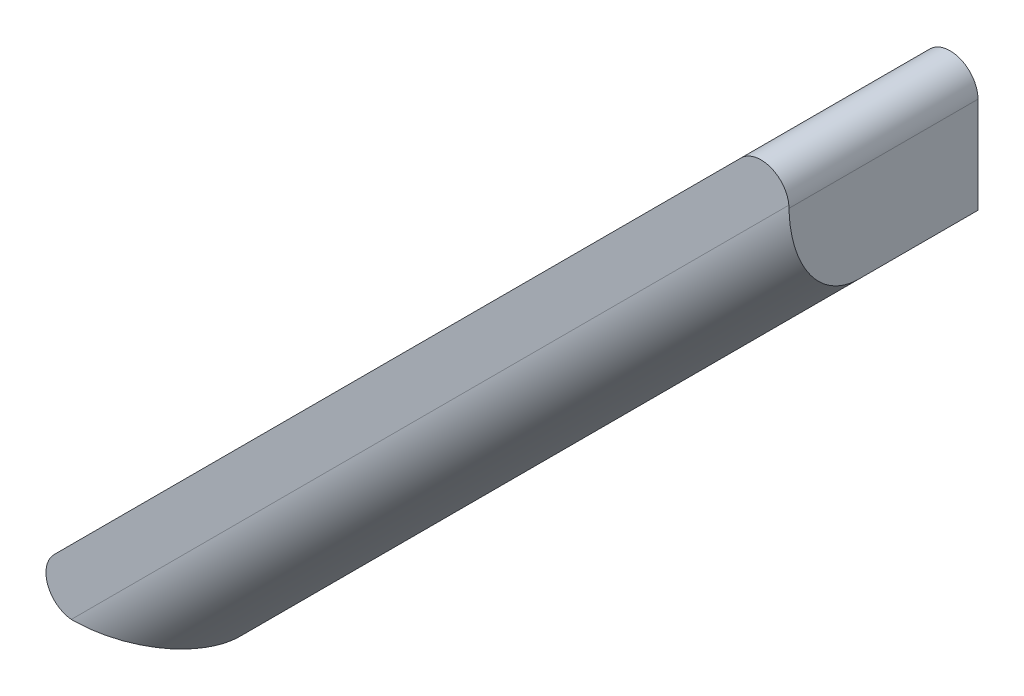
ISO-10303-21;
HEADER;
FILE_DESCRIPTION(('STEP AP214'),'2;1');
FILE_NAME('part.step','',(''),(''),'','','');
FILE_SCHEMA(('AUTOMOTIVE_DESIGN { 1 0 10303 214 1 1 1 1 }'));
ENDSEC;
DATA;
#1=APPLICATION_CONTEXT('core data for automotive mechanical design processes');
#2=APPLICATION_PROTOCOL_DEFINITION('international standard','automotive_design',2000,#1);
#3=PRODUCT_CONTEXT('',#1,'mechanical');
#4=PRODUCT('Part','Part','',(#3));
#5=PRODUCT_RELATED_PRODUCT_CATEGORY('part','',(#4));
#6=PRODUCT_DEFINITION_FORMATION('','',#4);
#7=PRODUCT_DEFINITION_CONTEXT('part definition',#1,'design');
#8=PRODUCT_DEFINITION('design','',#6,#7);
#9=PRODUCT_DEFINITION_SHAPE('','',#8);
#10=(LENGTH_UNIT() NAMED_UNIT(*) SI_UNIT(.MILLI.,.METRE.));
#11=(NAMED_UNIT(*) PLANE_ANGLE_UNIT() SI_UNIT($,.RADIAN.));
#12=(NAMED_UNIT(*) SI_UNIT($,.STERADIAN.) SOLID_ANGLE_UNIT());
#13=UNCERTAINTY_MEASURE_WITH_UNIT(LENGTH_MEASURE(1.E-05),#10,'distance_accuracy_value','');
#14=(GEOMETRIC_REPRESENTATION_CONTEXT(3) GLOBAL_UNCERTAINTY_ASSIGNED_CONTEXT((#13)) GLOBAL_UNIT_ASSIGNED_CONTEXT((#10,
#11,#12)) REPRESENTATION_CONTEXT('',''));
#15=CARTESIAN_POINT('',(0.,0.,0.));
#16=DIRECTION('',(0.,0.,1.));
#17=DIRECTION('',(1.,0.,0.));
#18=AXIS2_PLACEMENT_3D('',#15,#16,#17);
#19=CARTESIAN_POINT('',(-55.8941738241592,-55.8941738241592,13.5));
#20=DIRECTION('',(0.707106781186548,-0.707106781186547,0.));
#21=DIRECTION('',(0.707106781186547,0.707106781186548,0.));
#22=AXIS2_PLACEMENT_3D('',#19,#20,#21);
#23=PLANE('',#22);
#24=DIRECTION('',(-0.707106781186547,-0.707106781186547,0.));
#25=VECTOR('',#24,1.);
#26=CARTESIAN_POINT('',(-55.8941738241592,-55.8941738241592,13.5));
#27=LINE('',#26,#25);
#28=CARTESIAN_POINT('',(-3.41421356237312,-3.41421356237313,13.5));
#29=VERTEX_POINT('',#28);
#30=CARTESIAN_POINT('',(-52.4799602617861,-52.4799602617861,13.5));
#31=VERTEX_POINT('',#30);
#32=EDGE_CURVE('E119',#29,#31,#27,.T.);
#33=ORIENTED_EDGE('',*,*,#32,.F.);
#34=DIRECTION('',(0.,0.,-1.));
#35=VECTOR('',#34,1.);
#36=CARTESIAN_POINT('',(-3.4142135623731,-3.41421356237311,13.5));
#37=LINE('',#36,#35);
#38=CARTESIAN_POINT('',(-3.41421356237312,-3.41421356237313,0.));
#39=VERTEX_POINT('',#38);
#40=EDGE_CURVE('E133',#29,#39,#37,.T.);
#41=ORIENTED_EDGE('',*,*,#40,.T.);
#42=DIRECTION('',(-0.707106781186547,-0.707106781186547,0.));
#43=VECTOR('',#42,1.);
#44=CARTESIAN_POINT('',(-55.8941738241592,-55.8941738241592,0.));
#45=LINE('',#44,#43);
#46=CARTESIAN_POINT('',(-52.4799602617861,-52.4799602617861,0.));
#47=VERTEX_POINT('',#46);
#48=EDGE_CURVE('E112',#39,#47,#45,.T.);
#49=ORIENTED_EDGE('',*,*,#48,.T.);
#50=DIRECTION('',(0.,0.,-1.));
#51=VECTOR('',#50,1.);
#52=CARTESIAN_POINT('',(-52.4799602617861,-52.4799602617861,13.5));
#53=LINE('',#52,#51);
#54=EDGE_CURVE('E127',#47,#31,#53,.F.);
#55=ORIENTED_EDGE('',*,*,#54,.T.);
#56=EDGE_LOOP('',(#33,#41,#49,#55));
#57=FACE_BOUND('',#56,.T.);
#58=ADVANCED_FACE('F36',(#57),#23,.F.);
#59=CARTESIAN_POINT('',(-44.1941738241592,-55.8941738241592,13.5));
#60=DIRECTION('',(0.,1.,0.));
#61=DIRECTION('',(0.,0.,1.));
#62=AXIS2_PLACEMENT_3D('',#59,#60,#61);
#63=PLANE('',#62);
#64=DIRECTION('',(0.,0.,-1.));
#65=VECTOR('',#64,1.);
#66=CARTESIAN_POINT('',(-44.1941738241592,-55.8941738241592,13.5));
#67=LINE('',#66,#65);
#68=CARTESIAN_POINT('',(-44.1941738241592,-55.8941738241592,8.5));
#69=VERTEX_POINT('',#68);
#70=CARTESIAN_POINT('',(-44.1941738241592,-55.8941738241592,0.));
#71=VERTEX_POINT('',#70);
#72=EDGE_CURVE('E97',#69,#71,#67,.T.);
#73=ORIENTED_EDGE('',*,*,#72,.F.);
#74=CARTESIAN_POINT('',(-51.2652416360247,-55.8941738241592,8.5));
#75=DIRECTION('',(0.,1.,0.));
#76=DIRECTION('',(1.,0.,0.));
#77=AXIS2_PLACEMENT_3D('',#74,#75,#76);
#78=ELLIPSE('',#77,7.07106781186547,5.);
#79=CARTESIAN_POINT('',(-51.065746699413,-55.8941738241592,13.4980096923809));
#80=VERTEX_POINT('',#79);
#81=EDGE_CURVE('E49',#69,#80,#78,.F.);
#82=ORIENTED_EDGE('',*,*,#81,.T.);
#83=DIRECTION('',(0.,0.,-1.));
#84=VECTOR('',#83,1.);
#85=CARTESIAN_POINT('',(-51.065746699413,-55.8941738241592,13.5));
#86=LINE('',#85,#84);
#87=CARTESIAN_POINT('',(-51.065746699413,-55.8941738241592,0.));
#88=VERTEX_POINT('',#87);
#89=EDGE_CURVE('E103',#80,#88,#86,.T.);
#90=ORIENTED_EDGE('',*,*,#89,.T.);
#91=DIRECTION('',(1.,0.,0.));
#92=VECTOR('',#91,1.);
#93=CARTESIAN_POINT('',(-44.1941738241592,-55.8941738241592,0.));
#94=LINE('',#93,#92);
#95=EDGE_CURVE('E107',#88,#71,#94,.T.);
#96=ORIENTED_EDGE('',*,*,#95,.T.);
#97=EDGE_LOOP('',(#73,#82,#90,#96));
#98=FACE_BOUND('',#97,.T.);
#99=ADVANCED_FACE('F108',(#98),#63,.F.);
#100=CARTESIAN_POINT('',(0.,-11.7,13.5));
#101=DIRECTION('',(-0.707106781186548,0.707106781186547,0.));
#102=DIRECTION('',(-0.707106781186547,-0.707106781186548,0.));
#103=AXIS2_PLACEMENT_3D('',#100,#101,#102);
#104=PLANE('',#103);
#105=DIRECTION('',(0.,0.,-1.));
#106=VECTOR('',#105,1.);
#107=CARTESIAN_POINT('',(0.,-11.7,13.5));
#108=LINE('',#107,#106);
#109=CARTESIAN_POINT('',(0.,-11.7,8.5));
#110=VERTEX_POINT('',#109);
#111=CARTESIAN_POINT('',(0.,-11.7,0.));
#112=VERTEX_POINT('',#111);
#113=EDGE_CURVE('E104',#110,#112,#108,.T.);
#114=ORIENTED_EDGE('',*,*,#113,.F.);
#115=DIRECTION('',(0.707106781186547,0.707106781186548,0.));
#116=VECTOR('',#115,1.);
#117=CARTESIAN_POINT('',(0.,-11.7,8.5));
#118=LINE('',#117,#116);
#119=EDGE_CURVE('E63',#110,#69,#118,.F.);
#120=ORIENTED_EDGE('',*,*,#119,.T.);
#121=ORIENTED_EDGE('',*,*,#72,.T.);
#122=DIRECTION('',(0.707106781186547,0.707106781186548,0.));
#123=VECTOR('',#122,1.);
#124=CARTESIAN_POINT('',(0.,-11.7,0.));
#125=LINE('',#124,#123);
#126=EDGE_CURVE('E101',#71,#112,#125,.T.);
#127=ORIENTED_EDGE('',*,*,#126,.T.);
#128=EDGE_LOOP('',(#114,#120,#121,#127));
#129=FACE_BOUND('',#128,.T.);
#130=ADVANCED_FACE('F99',(#129),#104,.F.);
#131=CARTESIAN_POINT('',(0.,0.,13.5));
#132=DIRECTION('',(-1.,0.,0.));
#133=DIRECTION('',(0.,-1.,0.));
#134=AXIS2_PLACEMENT_3D('',#131,#132,#133);
#135=PLANE('',#134);
#136=DIRECTION('',(0.,0.,-1.));
#137=VECTOR('',#136,1.);
#138=CARTESIAN_POINT('',(0.,-4.8284271247462,13.5));
#139=LINE('',#138,#137);
#140=CARTESIAN_POINT('',(0.,-4.8284271247462,0.));
#141=VERTEX_POINT('',#140);
#142=CARTESIAN_POINT('',(0.,-4.8284271247462,13.4980096923809));
#143=VERTEX_POINT('',#142);
#144=EDGE_CURVE('E138',#141,#143,#139,.F.);
#145=ORIENTED_EDGE('',*,*,#144,.T.);
#146=CARTESIAN_POINT('',(0.,-4.62893218813452,8.5));
#147=DIRECTION('',(-1.,0.,0.));
#148=DIRECTION('',(0.,1.,0.));
#149=AXIS2_PLACEMENT_3D('',#146,#147,#148);
#150=ELLIPSE('',#149,7.07106781186547,5.);
#151=EDGE_CURVE('E151',#143,#110,#150,.F.);
#152=ORIENTED_EDGE('',*,*,#151,.T.);
#153=ORIENTED_EDGE('',*,*,#113,.T.);
#154=DIRECTION('',(0.,1.,0.));
#155=VECTOR('',#154,1.);
#156=CARTESIAN_POINT('',(0.,0.,0.));
#157=LINE('',#156,#155);
#158=EDGE_CURVE('E117',#112,#141,#157,.T.);
#159=ORIENTED_EDGE('',*,*,#158,.T.);
#160=EDGE_LOOP('',(#145,#152,#153,#159));
#161=FACE_BOUND('',#160,.T.);
#162=ADVANCED_FACE('F169',(#161),#135,.F.);
#163=CARTESIAN_POINT('',(0.,0.,13.5));
#164=DIRECTION('',(0.,0.,-1.));
#165=DIRECTION('',(-1.,0.,0.));
#166=AXIS2_PLACEMENT_3D('',#163,#164,#165);
#167=PLANE('',#166);
#168=CARTESIAN_POINT('',(-51.065746699413,-53.8941738241592,13.5));
#169=DIRECTION('',(0.,0.,-1.));
#170=DIRECTION('',(-1.,0.,0.));
#171=AXIS2_PLACEMENT_3D('',#168,#169,#170);
#172=CIRCLE('',#171,2.);
#173=CARTESIAN_POINT('',(-51.256156984165,-55.8850891722995,13.5));
#174=VERTEX_POINT('',#173);
#175=EDGE_CURVE('E130',#31,#174,#172,.F.);
#176=ORIENTED_EDGE('',*,*,#175,.T.);
#177=DIRECTION('',(0.707106781186547,0.707106781186548,0.));
#178=VECTOR('',#177,1.);
#179=CARTESIAN_POINT('',(2.31446609406726,-2.31446609406726,13.5));
#180=LINE('',#179,#178);
#181=CARTESIAN_POINT('',(-0.0090846518596881,-4.63801683999421,13.5));
#182=VERTEX_POINT('',#181);
#183=EDGE_CURVE('E143',#174,#182,#180,.T.);
#184=ORIENTED_EDGE('',*,*,#183,.T.);
#185=CARTESIAN_POINT('',(-2.,-4.8284271247462,13.5));
#186=DIRECTION('',(0.,0.,-1.));
#187=DIRECTION('',(-1.,0.,0.));
#188=AXIS2_PLACEMENT_3D('',#185,#186,#187);
#189=CIRCLE('',#188,2.);
#190=EDGE_CURVE('E141',#182,#29,#189,.F.);
#191=ORIENTED_EDGE('',*,*,#190,.T.);
#192=ORIENTED_EDGE('',*,*,#32,.T.);
#193=EDGE_LOOP('',(#176,#184,#191,#192));
#194=FACE_BOUND('',#193,.T.);
#195=ADVANCED_FACE('F172',(#194),#167,.F.);
#196=CARTESIAN_POINT('',(0.,0.,0.));
#197=DIRECTION('',(0.,0.,-1.));
#198=DIRECTION('',(-1.,0.,0.));
#199=AXIS2_PLACEMENT_3D('',#196,#197,#198);
#200=PLANE('',#199);
#201=ORIENTED_EDGE('',*,*,#48,.F.);
#202=CARTESIAN_POINT('',(-2.,-4.8284271247462,0.));
#203=DIRECTION('',(0.,0.,-1.));
#204=DIRECTION('',(-1.,0.,0.));
#205=AXIS2_PLACEMENT_3D('',#202,#203,#204);
#206=CIRCLE('',#205,2.);
#207=EDGE_CURVE('E136',#39,#141,#206,.T.);
#208=ORIENTED_EDGE('',*,*,#207,.T.);
#209=ORIENTED_EDGE('',*,*,#158,.F.);
#210=ORIENTED_EDGE('',*,*,#126,.F.);
#211=ORIENTED_EDGE('',*,*,#95,.F.);
#212=CARTESIAN_POINT('',(-51.065746699413,-53.8941738241592,0.));
#213=DIRECTION('',(0.,0.,-1.));
#214=DIRECTION('',(-1.,0.,0.));
#215=AXIS2_PLACEMENT_3D('',#212,#213,#214);
#216=CIRCLE('',#215,2.);
#217=EDGE_CURVE('E125',#88,#47,#216,.T.);
#218=ORIENTED_EDGE('',*,*,#217,.T.);
#219=EDGE_LOOP('',(#201,#208,#209,#210,#211,#218));
#220=FACE_BOUND('',#219,.T.);
#221=ADVANCED_FACE('F115',(#220),#200,.T.);
#222=CARTESIAN_POINT('',(-51.065746699413,-53.8941738241592,13.5));
#223=DIRECTION('',(0.,0.,-1.));
#224=DIRECTION('',(-1.,0.,0.));
#225=AXIS2_PLACEMENT_3D('',#222,#223,#224);
#226=CYLINDRICAL_SURFACE('',#225,2.);
#227=ORIENTED_EDGE('',*,*,#89,.F.);
#228=CARTESIAN_POINT('',(-51.065746699413,-55.8941738241592,13.4980096923809));
#229=CARTESIAN_POINT('',(-51.0975506372731,-55.8941731213124,13.4986586111222));
#230=CARTESIAN_POINT('',(-51.1293201299411,-55.8934157155665,13.4991489294611));
#231=CARTESIAN_POINT('',(-51.1927902248584,-55.8903874982783,13.4998123653338));
#232=CARTESIAN_POINT('',(-51.2244908271076,-55.8881166867376,13.4999854828679));
#233=CARTESIAN_POINT('',(-51.256156984165,-55.8850891722995,13.5));
#234=B_SPLINE_CURVE_WITH_KNOTS('',3,(#228,#229,#230,#231,#232,#233),.UNSPECIFIED.,.F.,.F.,(4,2,
4),(0.,0.0953469069205512,0.190693813736101),.UNSPECIFIED.);
#235=EDGE_CURVE('E11',#80,#174,#234,.T.);
#236=ORIENTED_EDGE('',*,*,#235,.T.);
#237=ORIENTED_EDGE('',*,*,#175,.F.);
#238=ORIENTED_EDGE('',*,*,#54,.F.);
#239=ORIENTED_EDGE('',*,*,#217,.F.);
#240=EDGE_LOOP('',(#227,#236,#237,#238,#239));
#241=FACE_BOUND('',#240,.T.);
#242=ADVANCED_FACE('F156',(#241),#226,.T.);
#243=CARTESIAN_POINT('',(-2.,-4.8284271247462,13.5));
#244=DIRECTION('',(0.,0.,-1.));
#245=DIRECTION('',(-1.,0.,0.));
#246=AXIS2_PLACEMENT_3D('',#243,#244,#245);
#247=CYLINDRICAL_SURFACE('',#246,2.);
#248=ORIENTED_EDGE('',*,*,#190,.F.);
#249=CARTESIAN_POINT('',(-0.00908465185968832,-4.63801683999421,13.5));
#250=CARTESIAN_POINT('',(-0.00605713742162079,-4.66968299705157,13.4999854828679));
#251=CARTESIAN_POINT('',(-0.00378632588094666,-4.70138359930082,13.4998123653338));
#252=CARTESIAN_POINT('',(-0.000758108592717661,-4.76485369421808,13.4991489294611));
#253=CARTESIAN_POINT('',(-7.02846829552514E-07,-4.79662318688615,13.4986586111222));
#254=CARTESIAN_POINT('',(0.,-4.8284271247462,13.4980096923809));
#255=B_SPLINE_CURVE_WITH_KNOTS('',3,(#249,#250,#251,#252,#253,#254),.UNSPECIFIED.,.F.,.F.,(4,2,
4),(0.,0.0953469068155547,0.190693813736118),.UNSPECIFIED.);
#256=EDGE_CURVE('E146',#182,#143,#255,.T.);
#257=ORIENTED_EDGE('',*,*,#256,.T.);
#258=ORIENTED_EDGE('',*,*,#144,.F.);
#259=ORIENTED_EDGE('',*,*,#207,.F.);
#260=ORIENTED_EDGE('',*,*,#40,.F.);
#261=EDGE_LOOP('',(#248,#257,#258,#259,#260));
#262=FACE_BOUND('',#261,.T.);
#263=ADVANCED_FACE('F153',(#262),#247,.T.);
#264=CARTESIAN_POINT('',(2.31446609406726,-2.31446609406726,8.5));
#265=DIRECTION('',(0.707106781186547,0.707106781186548,0.));
#266=DIRECTION('',(-0.707106781186548,0.707106781186547,0.));
#267=AXIS2_PLACEMENT_3D('',#264,#265,#266);
#268=CYLINDRICAL_SURFACE('',#267,5.);
#269=ORIENTED_EDGE('',*,*,#81,.F.);
#270=ORIENTED_EDGE('',*,*,#119,.F.);
#271=ORIENTED_EDGE('',*,*,#151,.F.);
#272=ORIENTED_EDGE('',*,*,#256,.F.);
#273=ORIENTED_EDGE('',*,*,#183,.F.);
#274=ORIENTED_EDGE('',*,*,#235,.F.);
#275=EDGE_LOOP('',(#269,#270,#271,#272,#273,#274));
#276=FACE_BOUND('',#275,.T.);
#277=ADVANCED_FACE('F38',(#276),#268,.T.);
#278=CLOSED_SHELL('',(#58,#99,#130,#162,#195,#221,#242,#263,#277));
#279=MANIFOLD_SOLID_BREP('B2',#278);
#280=ADVANCED_BREP_SHAPE_REPRESENTATION('',(#18,#279),#14);
#281=SHAPE_DEFINITION_REPRESENTATION(#9,#280);
ENDSEC;
END-ISO-10303-21;
